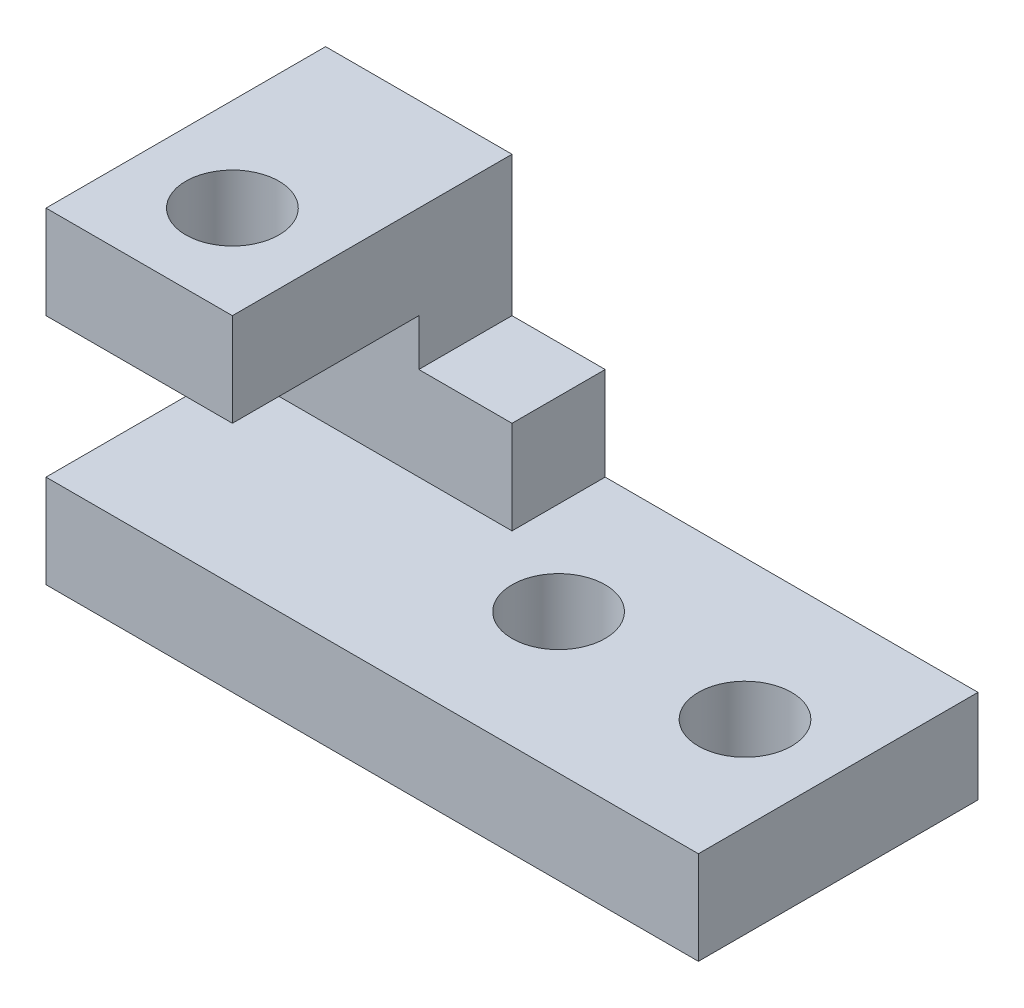
ISO-10303-21;
HEADER;
FILE_DESCRIPTION(('STEP AP214'),'2;1');
FILE_NAME('part.step','',(''),(''),'','','');
FILE_SCHEMA(('AUTOMOTIVE_DESIGN { 1 0 10303 214 1 1 1 1 }'));
ENDSEC;
DATA;
#1=APPLICATION_CONTEXT('core data for automotive mechanical design processes');
#2=APPLICATION_PROTOCOL_DEFINITION('international standard','automotive_design',2000,#1);
#3=PRODUCT_CONTEXT('',#1,'mechanical');
#4=PRODUCT('Part','Part','',(#3));
#5=PRODUCT_RELATED_PRODUCT_CATEGORY('part','',(#4));
#6=PRODUCT_DEFINITION_FORMATION('','',#4);
#7=PRODUCT_DEFINITION_CONTEXT('part definition',#1,'design');
#8=PRODUCT_DEFINITION('design','',#6,#7);
#9=PRODUCT_DEFINITION_SHAPE('','',#8);
#10=(LENGTH_UNIT() NAMED_UNIT(*) SI_UNIT(.MILLI.,.METRE.));
#11=(NAMED_UNIT(*) PLANE_ANGLE_UNIT() SI_UNIT($,.RADIAN.));
#12=(NAMED_UNIT(*) SI_UNIT($,.STERADIAN.) SOLID_ANGLE_UNIT());
#13=UNCERTAINTY_MEASURE_WITH_UNIT(LENGTH_MEASURE(1.E-05),#10,'distance_accuracy_value','');
#14=(GEOMETRIC_REPRESENTATION_CONTEXT(3) GLOBAL_UNCERTAINTY_ASSIGNED_CONTEXT((#13)) GLOBAL_UNIT_ASSIGNED_CONTEXT((#10,
#11,#12)) REPRESENTATION_CONTEXT('',''));
#15=CARTESIAN_POINT('',(0.,0.,0.));
#16=DIRECTION('',(0.,0.,1.));
#17=DIRECTION('',(1.,0.,0.));
#18=AXIS2_PLACEMENT_3D('',#15,#16,#17);
#19=CARTESIAN_POINT('',(0.,35.,-20.));
#20=DIRECTION('',(0.,0.,-1.));
#21=DIRECTION('',(-1.,0.,0.));
#22=AXIS2_PLACEMENT_3D('',#19,#20,#21);
#23=PLANE('',#22);
#24=DIRECTION('',(1.,0.,0.));
#25=VECTOR('',#24,1.);
#26=CARTESIAN_POINT('',(0.,25.,-20.));
#27=LINE('',#26,#25);
#28=CARTESIAN_POINT('',(0.,25.,-20.));
#29=VERTEX_POINT('',#28);
#30=CARTESIAN_POINT('',(20.,25.,-20.));
#31=VERTEX_POINT('',#30);
#32=EDGE_CURVE('E142',#29,#31,#27,.T.);
#33=ORIENTED_EDGE('',*,*,#32,.F.);
#34=DIRECTION('',(0.,-1.,0.));
#35=VECTOR('',#34,1.);
#36=CARTESIAN_POINT('',(0.,35.,-20.));
#37=LINE('',#36,#35);
#38=CARTESIAN_POINT('',(0.,10.,-20.));
#39=VERTEX_POINT('',#38);
#40=EDGE_CURVE('E147',#29,#39,#37,.T.);
#41=ORIENTED_EDGE('',*,*,#40,.T.);
#42=DIRECTION('',(1.,0.,0.));
#43=VECTOR('',#42,1.);
#44=CARTESIAN_POINT('',(0.,10.,-20.));
#45=LINE('',#44,#43);
#46=CARTESIAN_POINT('',(30.,10.,-20.));
#47=VERTEX_POINT('',#46);
#48=EDGE_CURVE('E171',#39,#47,#45,.T.);
#49=ORIENTED_EDGE('',*,*,#48,.T.);
#50=DIRECTION('',(0.,-1.,0.));
#51=VECTOR('',#50,1.);
#52=CARTESIAN_POINT('',(30.,35.,-20.));
#53=LINE('',#52,#51);
#54=CARTESIAN_POINT('',(30.,20.,-20.));
#55=VERTEX_POINT('',#54);
#56=EDGE_CURVE('E194',#55,#47,#53,.T.);
#57=ORIENTED_EDGE('',*,*,#56,.F.);
#58=DIRECTION('',(1.,0.,0.));
#59=VECTOR('',#58,1.);
#60=CARTESIAN_POINT('',(30.,20.,-20.));
#61=LINE('',#60,#59);
#62=CARTESIAN_POINT('',(20.,20.,-20.));
#63=VERTEX_POINT('',#62);
#64=EDGE_CURVE('E153',#63,#55,#61,.T.);
#65=ORIENTED_EDGE('',*,*,#64,.F.);
#66=DIRECTION('',(0.,-1.,0.));
#67=VECTOR('',#66,1.);
#68=CARTESIAN_POINT('',(20.,35.,-20.));
#69=LINE('',#68,#67);
#70=EDGE_CURVE('E149',#31,#63,#69,.T.);
#71=ORIENTED_EDGE('',*,*,#70,.F.);
#72=EDGE_LOOP('',(#33,#41,#49,#57,#65,#71));
#73=FACE_BOUND('',#72,.T.);
#74=ADVANCED_FACE('F39',(#73),#23,.F.);
#75=CARTESIAN_POINT('',(0.,10.,0.));
#76=DIRECTION('',(0.,-1.,0.));
#77=DIRECTION('',(0.,0.,-1.));
#78=AXIS2_PLACEMENT_3D('',#75,#76,#77);
#79=PLANE('',#78);
#80=CARTESIAN_POINT('',(40.,10.,-15.));
#81=DIRECTION('',(0.,1.,0.));
#82=DIRECTION('',(0.,0.,1.));
#83=AXIS2_PLACEMENT_3D('',#80,#81,#82);
#84=CIRCLE('',#83,5.);
#85=CARTESIAN_POINT('',(40.,10.,-9.99999999999999));
#86=VERTEX_POINT('',#85);
#87=EDGE_CURVE('E271',#86,#86,#84,.T.);
#88=ORIENTED_EDGE('',*,*,#87,.F.);
#89=EDGE_LOOP('',(#88));
#90=FACE_BOUND('',#89,.T.);
#91=CARTESIAN_POINT('',(60.,10.,-15.));
#92=DIRECTION('',(0.,1.,0.));
#93=DIRECTION('',(0.,0.,1.));
#94=AXIS2_PLACEMENT_3D('',#91,#92,#93);
#95=CIRCLE('',#94,5.);
#96=CARTESIAN_POINT('',(60.,10.,-9.99999999999999));
#97=VERTEX_POINT('',#96);
#98=EDGE_CURVE('E278',#97,#97,#95,.T.);
#99=ORIENTED_EDGE('',*,*,#98,.F.);
#100=EDGE_LOOP('',(#99));
#101=FACE_BOUND('',#100,.T.);
#102=DIRECTION('',(0.,0.,-1.));
#103=VECTOR('',#102,1.);
#104=CARTESIAN_POINT('',(30.,10.,-30.));
#105=LINE('',#104,#103);
#106=CARTESIAN_POINT('',(30.,10.,-30.));
#107=VERTEX_POINT('',#106);
#108=EDGE_CURVE('E182',#47,#107,#105,.T.);
#109=ORIENTED_EDGE('',*,*,#108,.F.);
#110=ORIENTED_EDGE('',*,*,#48,.F.);
#111=DIRECTION('',(0.,0.,1.));
#112=VECTOR('',#111,1.);
#113=CARTESIAN_POINT('',(0.,10.,0.));
#114=LINE('',#113,#112);
#115=CARTESIAN_POINT('',(0.,10.,0.));
#116=VERTEX_POINT('',#115);
#117=EDGE_CURVE('E200',#39,#116,#114,.T.);
#118=ORIENTED_EDGE('',*,*,#117,.T.);
#119=DIRECTION('',(1.,0.,0.));
#120=VECTOR('',#119,1.);
#121=CARTESIAN_POINT('',(0.,10.,0.));
#122=LINE('',#121,#120);
#123=CARTESIAN_POINT('',(70.,10.,0.));
#124=VERTEX_POINT('',#123);
#125=EDGE_CURVE('E203',#116,#124,#122,.T.);
#126=ORIENTED_EDGE('',*,*,#125,.T.);
#127=DIRECTION('',(0.,0.,-1.));
#128=VECTOR('',#127,1.);
#129=CARTESIAN_POINT('',(70.,10.,0.));
#130=LINE('',#129,#128);
#131=CARTESIAN_POINT('',(70.,10.,-30.));
#132=VERTEX_POINT('',#131);
#133=EDGE_CURVE('E207',#124,#132,#130,.T.);
#134=ORIENTED_EDGE('',*,*,#133,.T.);
#135=DIRECTION('',(-1.,0.,0.));
#136=VECTOR('',#135,1.);
#137=CARTESIAN_POINT('',(0.,10.,-30.));
#138=LINE('',#137,#136);
#139=EDGE_CURVE('E210',#132,#107,#138,.T.);
#140=ORIENTED_EDGE('',*,*,#139,.T.);
#141=EDGE_LOOP('',(#109,#110,#118,#126,#134,#140));
#142=FACE_BOUND('',#141,.T.);
#143=ADVANCED_FACE('F263',(#90,#101,#142),#79,.F.);
#144=CARTESIAN_POINT('',(0.,10.,0.));
#145=DIRECTION('',(1.,0.,0.));
#146=DIRECTION('',(0.,0.,-1.));
#147=AXIS2_PLACEMENT_3D('',#144,#145,#146);
#148=PLANE('',#147);
#149=DIRECTION('',(0.,0.,1.));
#150=VECTOR('',#149,1.);
#151=CARTESIAN_POINT('',(0.,0.,0.));
#152=LINE('',#151,#150);
#153=CARTESIAN_POINT('',(0.,0.,-30.));
#154=VERTEX_POINT('',#153);
#155=CARTESIAN_POINT('',(0.,0.,0.));
#156=VERTEX_POINT('',#155);
#157=EDGE_CURVE('E199',#154,#156,#152,.T.);
#158=ORIENTED_EDGE('',*,*,#157,.T.);
#159=DIRECTION('',(0.,-1.,0.));
#160=VECTOR('',#159,1.);
#161=CARTESIAN_POINT('',(0.,10.,0.));
#162=LINE('',#161,#160);
#163=EDGE_CURVE('E11',#116,#156,#162,.T.);
#164=ORIENTED_EDGE('',*,*,#163,.F.);
#165=ORIENTED_EDGE('',*,*,#117,.F.);
#166=ORIENTED_EDGE('',*,*,#40,.F.);
#167=DIRECTION('',(0.,0.,-1.));
#168=VECTOR('',#167,1.);
#169=CARTESIAN_POINT('',(0.,25.,0.));
#170=LINE('',#169,#168);
#171=CARTESIAN_POINT('',(0.,25.,0.));
#172=VERTEX_POINT('',#171);
#173=EDGE_CURVE('E126',#172,#29,#170,.T.);
#174=ORIENTED_EDGE('',*,*,#173,.F.);
#175=DIRECTION('',(0.,-1.,0.));
#176=VECTOR('',#175,1.);
#177=CARTESIAN_POINT('',(0.,35.,0.));
#178=LINE('',#177,#176);
#179=CARTESIAN_POINT('',(0.,35.,0.));
#180=VERTEX_POINT('',#179);
#181=EDGE_CURVE('E132',#180,#172,#178,.T.);
#182=ORIENTED_EDGE('',*,*,#181,.F.);
#183=DIRECTION('',(0.,0.,1.));
#184=VECTOR('',#183,1.);
#185=CARTESIAN_POINT('',(0.,35.,-30.));
#186=LINE('',#185,#184);
#187=CARTESIAN_POINT('',(0.,35.,-30.));
#188=VERTEX_POINT('',#187);
#189=EDGE_CURVE('E178',#188,#180,#186,.T.);
#190=ORIENTED_EDGE('',*,*,#189,.F.);
#191=DIRECTION('',(0.,-1.,0.));
#192=VECTOR('',#191,1.);
#193=CARTESIAN_POINT('',(0.,10.,-30.));
#194=LINE('',#193,#192);
#195=EDGE_CURVE('E214',#188,#154,#194,.T.);
#196=ORIENTED_EDGE('',*,*,#195,.T.);
#197=EDGE_LOOP('',(#158,#164,#165,#166,#174,#182,#190,#196));
#198=FACE_BOUND('',#197,.T.);
#199=ADVANCED_FACE('F41',(#198),#148,.F.);
#200=CARTESIAN_POINT('',(0.,10.,0.));
#201=DIRECTION('',(0.,0.,-1.));
#202=DIRECTION('',(-1.,0.,0.));
#203=AXIS2_PLACEMENT_3D('',#200,#201,#202);
#204=PLANE('',#203);
#205=DIRECTION('',(1.,0.,0.));
#206=VECTOR('',#205,1.);
#207=CARTESIAN_POINT('',(0.,0.,0.));
#208=LINE('',#207,#206);
#209=CARTESIAN_POINT('',(70.,0.,0.));
#210=VERTEX_POINT('',#209);
#211=EDGE_CURVE('E217',#156,#210,#208,.T.);
#212=ORIENTED_EDGE('',*,*,#211,.T.);
#213=DIRECTION('',(0.,-1.,0.));
#214=VECTOR('',#213,1.);
#215=CARTESIAN_POINT('',(70.,10.,0.));
#216=LINE('',#215,#214);
#217=EDGE_CURVE('E49',#124,#210,#216,.T.);
#218=ORIENTED_EDGE('',*,*,#217,.F.);
#219=ORIENTED_EDGE('',*,*,#125,.F.);
#220=ORIENTED_EDGE('',*,*,#163,.T.);
#221=EDGE_LOOP('',(#212,#218,#219,#220));
#222=FACE_BOUND('',#221,.T.);
#223=ADVANCED_FACE('F325',(#222),#204,.F.);
#224=CARTESIAN_POINT('',(70.,10.,0.));
#225=DIRECTION('',(-1.,0.,0.));
#226=DIRECTION('',(0.,0.,1.));
#227=AXIS2_PLACEMENT_3D('',#224,#225,#226);
#228=PLANE('',#227);
#229=DIRECTION('',(0.,0.,-1.));
#230=VECTOR('',#229,1.);
#231=CARTESIAN_POINT('',(70.,0.,0.));
#232=LINE('',#231,#230);
#233=CARTESIAN_POINT('',(70.,0.,-30.));
#234=VERTEX_POINT('',#233);
#235=EDGE_CURVE('E220',#210,#234,#232,.T.);
#236=ORIENTED_EDGE('',*,*,#235,.T.);
#237=DIRECTION('',(0.,-1.,0.));
#238=VECTOR('',#237,1.);
#239=CARTESIAN_POINT('',(70.,10.,-30.));
#240=LINE('',#239,#238);
#241=EDGE_CURVE('E228',#132,#234,#240,.T.);
#242=ORIENTED_EDGE('',*,*,#241,.F.);
#243=ORIENTED_EDGE('',*,*,#133,.F.);
#244=ORIENTED_EDGE('',*,*,#217,.T.);
#245=EDGE_LOOP('',(#236,#242,#243,#244));
#246=FACE_BOUND('',#245,.T.);
#247=ADVANCED_FACE('F238',(#246),#228,.F.);
#248=CARTESIAN_POINT('',(0.,10.,-30.));
#249=DIRECTION('',(0.,0.,1.));
#250=DIRECTION('',(1.,0.,0.));
#251=AXIS2_PLACEMENT_3D('',#248,#249,#250);
#252=PLANE('',#251);
#253=DIRECTION('',(0.,-1.,0.));
#254=VECTOR('',#253,1.);
#255=CARTESIAN_POINT('',(20.,35.,-30.));
#256=LINE('',#255,#254);
#257=CARTESIAN_POINT('',(20.,35.,-30.));
#258=VERTEX_POINT('',#257);
#259=CARTESIAN_POINT('',(20.,20.,-30.));
#260=VERTEX_POINT('',#259);
#261=EDGE_CURVE('E63',#258,#260,#256,.T.);
#262=ORIENTED_EDGE('',*,*,#261,.T.);
#263=DIRECTION('',(1.,0.,0.));
#264=VECTOR('',#263,1.);
#265=CARTESIAN_POINT('',(30.,20.,-30.));
#266=LINE('',#265,#264);
#267=CARTESIAN_POINT('',(30.,20.,-30.));
#268=VERTEX_POINT('',#267);
#269=EDGE_CURVE('E160',#260,#268,#266,.T.);
#270=ORIENTED_EDGE('',*,*,#269,.T.);
#271=DIRECTION('',(0.,-1.,0.));
#272=VECTOR('',#271,1.);
#273=CARTESIAN_POINT('',(30.,35.,-30.));
#274=LINE('',#273,#272);
#275=EDGE_CURVE('E185',#268,#107,#274,.T.);
#276=ORIENTED_EDGE('',*,*,#275,.T.);
#277=ORIENTED_EDGE('',*,*,#139,.F.);
#278=ORIENTED_EDGE('',*,*,#241,.T.);
#279=DIRECTION('',(-1.,0.,0.));
#280=VECTOR('',#279,1.);
#281=CARTESIAN_POINT('',(0.,0.,-30.));
#282=LINE('',#281,#280);
#283=EDGE_CURVE('E204',#234,#154,#282,.T.);
#284=ORIENTED_EDGE('',*,*,#283,.T.);
#285=ORIENTED_EDGE('',*,*,#195,.F.);
#286=DIRECTION('',(-1.,0.,0.));
#287=VECTOR('',#286,1.);
#288=CARTESIAN_POINT('',(0.,35.,-30.));
#289=LINE('',#288,#287);
#290=EDGE_CURVE('E181',#258,#188,#289,.T.);
#291=ORIENTED_EDGE('',*,*,#290,.F.);
#292=EDGE_LOOP('',(#262,#270,#276,#277,#278,#284,#285,#291));
#293=FACE_BOUND('',#292,.T.);
#294=ADVANCED_FACE('F248',(#293),#252,.F.);
#295=CARTESIAN_POINT('',(0.,0.,0.));
#296=DIRECTION('',(0.,-1.,0.));
#297=DIRECTION('',(0.,0.,-1.));
#298=AXIS2_PLACEMENT_3D('',#295,#296,#297);
#299=PLANE('',#298);
#300=CARTESIAN_POINT('',(40.,0.,-15.));
#301=DIRECTION('',(0.,1.,0.));
#302=DIRECTION('',(0.,0.,1.));
#303=AXIS2_PLACEMENT_3D('',#300,#301,#302);
#304=CIRCLE('',#303,5.);
#305=CARTESIAN_POINT('',(40.,0.,-9.99999999999999));
#306=VERTEX_POINT('',#305);
#307=EDGE_CURVE('E268',#306,#306,#304,.T.);
#308=ORIENTED_EDGE('',*,*,#307,.T.);
#309=EDGE_LOOP('',(#308));
#310=FACE_BOUND('',#309,.T.);
#311=CARTESIAN_POINT('',(60.,0.,-15.));
#312=DIRECTION('',(0.,1.,0.));
#313=DIRECTION('',(0.,0.,1.));
#314=AXIS2_PLACEMENT_3D('',#311,#312,#313);
#315=CIRCLE('',#314,5.);
#316=CARTESIAN_POINT('',(60.,0.,-9.99999999999999));
#317=VERTEX_POINT('',#316);
#318=EDGE_CURVE('E282',#317,#317,#315,.T.);
#319=ORIENTED_EDGE('',*,*,#318,.T.);
#320=EDGE_LOOP('',(#319));
#321=FACE_BOUND('',#320,.T.);
#322=ORIENTED_EDGE('',*,*,#157,.F.);
#323=ORIENTED_EDGE('',*,*,#283,.F.);
#324=ORIENTED_EDGE('',*,*,#235,.F.);
#325=ORIENTED_EDGE('',*,*,#211,.F.);
#326=EDGE_LOOP('',(#322,#323,#324,#325));
#327=FACE_BOUND('',#326,.T.);
#328=ADVANCED_FACE('F245',(#310,#321,#327),#299,.T.);
#329=CARTESIAN_POINT('',(30.,35.,-30.));
#330=DIRECTION('',(-1.,0.,0.));
#331=DIRECTION('',(0.,0.,1.));
#332=AXIS2_PLACEMENT_3D('',#329,#330,#331);
#333=PLANE('',#332);
#334=ORIENTED_EDGE('',*,*,#275,.F.);
#335=DIRECTION('',(0.,0.,1.));
#336=VECTOR('',#335,1.);
#337=CARTESIAN_POINT('',(30.,20.,-30.));
#338=LINE('',#337,#336);
#339=EDGE_CURVE('E167',#268,#55,#338,.T.);
#340=ORIENTED_EDGE('',*,*,#339,.T.);
#341=ORIENTED_EDGE('',*,*,#56,.T.);
#342=ORIENTED_EDGE('',*,*,#108,.T.);
#343=EDGE_LOOP('',(#334,#340,#341,#342));
#344=FACE_BOUND('',#343,.T.);
#345=ADVANCED_FACE('F258',(#344),#333,.F.);
#346=CARTESIAN_POINT('',(0.,35.,0.));
#347=DIRECTION('',(0.,1.,0.));
#348=DIRECTION('',(0.,0.,1.));
#349=AXIS2_PLACEMENT_3D('',#346,#347,#348);
#350=PLANE('',#349);
#351=CARTESIAN_POINT('',(10.,35.,-10.));
#352=DIRECTION('',(0.,1.,0.));
#353=DIRECTION('',(0.,0.,1.));
#354=AXIS2_PLACEMENT_3D('',#351,#352,#353);
#355=CIRCLE('',#354,5.);
#356=CARTESIAN_POINT('',(10.,35.,-5.));
#357=VERTEX_POINT('',#356);
#358=EDGE_CURVE('E289',#357,#357,#355,.T.);
#359=ORIENTED_EDGE('',*,*,#358,.F.);
#360=EDGE_LOOP('',(#359));
#361=FACE_BOUND('',#360,.T.);
#362=DIRECTION('',(0.,0.,1.));
#363=VECTOR('',#362,1.);
#364=CARTESIAN_POINT('',(20.,35.,-30.));
#365=LINE('',#364,#363);
#366=CARTESIAN_POINT('',(20.,35.,0.));
#367=VERTEX_POINT('',#366);
#368=EDGE_CURVE('E163',#258,#367,#365,.T.);
#369=ORIENTED_EDGE('',*,*,#368,.F.);
#370=ORIENTED_EDGE('',*,*,#290,.T.);
#371=ORIENTED_EDGE('',*,*,#189,.T.);
#372=DIRECTION('',(-1.,0.,0.));
#373=VECTOR('',#372,1.);
#374=CARTESIAN_POINT('',(0.,35.,0.));
#375=LINE('',#374,#373);
#376=EDGE_CURVE('E138',#367,#180,#375,.T.);
#377=ORIENTED_EDGE('',*,*,#376,.F.);
#378=EDGE_LOOP('',(#369,#370,#371,#377));
#379=FACE_BOUND('',#378,.T.);
#380=ADVANCED_FACE('F253',(#361,#379),#350,.T.);
#381=CARTESIAN_POINT('',(30.,20.,-30.));
#382=DIRECTION('',(0.,-1.,0.));
#383=DIRECTION('',(0.,0.,-1.));
#384=AXIS2_PLACEMENT_3D('',#381,#382,#383);
#385=PLANE('',#384);
#386=ORIENTED_EDGE('',*,*,#64,.T.);
#387=ORIENTED_EDGE('',*,*,#339,.F.);
#388=ORIENTED_EDGE('',*,*,#269,.F.);
#389=DIRECTION('',(0.,0.,1.));
#390=VECTOR('',#389,1.);
#391=CARTESIAN_POINT('',(20.,20.,-30.));
#392=LINE('',#391,#390);
#393=EDGE_CURVE('E172',#260,#63,#392,.T.);
#394=ORIENTED_EDGE('',*,*,#393,.T.);
#395=EDGE_LOOP('',(#386,#387,#388,#394));
#396=FACE_BOUND('',#395,.T.);
#397=ADVANCED_FACE('F375',(#396),#385,.F.);
#398=CARTESIAN_POINT('',(20.,35.,-30.));
#399=DIRECTION('',(-1.,0.,0.));
#400=DIRECTION('',(0.,0.,1.));
#401=AXIS2_PLACEMENT_3D('',#398,#399,#400);
#402=PLANE('',#401);
#403=ORIENTED_EDGE('',*,*,#368,.T.);
#404=DIRECTION('',(0.,1.,0.));
#405=VECTOR('',#404,1.);
#406=CARTESIAN_POINT('',(20.,35.,0.));
#407=LINE('',#406,#405);
#408=CARTESIAN_POINT('',(20.,25.,0.));
#409=VERTEX_POINT('',#408);
#410=EDGE_CURVE('E131',#409,#367,#407,.T.);
#411=ORIENTED_EDGE('',*,*,#410,.F.);
#412=DIRECTION('',(0.,0.,-1.));
#413=VECTOR('',#412,1.);
#414=CARTESIAN_POINT('',(20.,25.,0.));
#415=LINE('',#414,#413);
#416=EDGE_CURVE('E56',#409,#31,#415,.T.);
#417=ORIENTED_EDGE('',*,*,#416,.T.);
#418=ORIENTED_EDGE('',*,*,#70,.T.);
#419=ORIENTED_EDGE('',*,*,#393,.F.);
#420=ORIENTED_EDGE('',*,*,#261,.F.);
#421=EDGE_LOOP('',(#403,#411,#417,#418,#419,#420));
#422=FACE_BOUND('',#421,.T.);
#423=ADVANCED_FACE('F386',(#422),#402,.F.);
#424=CARTESIAN_POINT('',(0.,25.,0.));
#425=DIRECTION('',(0.,1.,0.));
#426=DIRECTION('',(0.,0.,1.));
#427=AXIS2_PLACEMENT_3D('',#424,#425,#426);
#428=PLANE('',#427);
#429=CARTESIAN_POINT('',(10.,25.,-10.));
#430=DIRECTION('',(0.,1.,0.));
#431=DIRECTION('',(0.,0.,1.));
#432=AXIS2_PLACEMENT_3D('',#429,#430,#431);
#433=CIRCLE('',#432,5.);
#434=CARTESIAN_POINT('',(10.,25.,-5.));
#435=VERTEX_POINT('',#434);
#436=EDGE_CURVE('E43',#435,#435,#433,.T.);
#437=ORIENTED_EDGE('',*,*,#436,.T.);
#438=EDGE_LOOP('',(#437));
#439=FACE_BOUND('',#438,.T.);
#440=ORIENTED_EDGE('',*,*,#32,.T.);
#441=ORIENTED_EDGE('',*,*,#416,.F.);
#442=DIRECTION('',(1.,0.,0.));
#443=VECTOR('',#442,1.);
#444=CARTESIAN_POINT('',(0.,25.,0.));
#445=LINE('',#444,#443);
#446=EDGE_CURVE('E122',#172,#409,#445,.T.);
#447=ORIENTED_EDGE('',*,*,#446,.F.);
#448=ORIENTED_EDGE('',*,*,#173,.T.);
#449=EDGE_LOOP('',(#440,#441,#447,#448));
#450=FACE_BOUND('',#449,.T.);
#451=ADVANCED_FACE('F124',(#439,#450),#428,.F.);
#452=CARTESIAN_POINT('',(0.,0.,0.));
#453=DIRECTION('',(0.,0.,1.));
#454=DIRECTION('',(1.,0.,0.));
#455=AXIS2_PLACEMENT_3D('',#452,#453,#454);
#456=PLANE('',#455);
#457=ORIENTED_EDGE('',*,*,#181,.T.);
#458=ORIENTED_EDGE('',*,*,#446,.T.);
#459=ORIENTED_EDGE('',*,*,#410,.T.);
#460=ORIENTED_EDGE('',*,*,#376,.T.);
#461=EDGE_LOOP('',(#457,#458,#459,#460));
#462=FACE_BOUND('',#461,.T.);
#463=ADVANCED_FACE('F136',(#462),#456,.T.);
#464=CARTESIAN_POINT('',(60.,0.,-15.));
#465=DIRECTION('',(0.,1.,0.));
#466=DIRECTION('',(0.,0.,1.));
#467=AXIS2_PLACEMENT_3D('',#464,#465,#466);
#468=CYLINDRICAL_SURFACE('',#467,5.);
#469=ORIENTED_EDGE('',*,*,#318,.F.);
#470=EDGE_LOOP('',(#469));
#471=FACE_BOUND('',#470,.T.);
#472=ORIENTED_EDGE('',*,*,#98,.T.);
#473=EDGE_LOOP('',(#472));
#474=FACE_BOUND('',#473,.T.);
#475=ADVANCED_FACE('F306',(#471,#474),#468,.F.);
#476=CARTESIAN_POINT('',(40.,0.,-15.));
#477=DIRECTION('',(0.,1.,0.));
#478=DIRECTION('',(0.,0.,1.));
#479=AXIS2_PLACEMENT_3D('',#476,#477,#478);
#480=CYLINDRICAL_SURFACE('',#479,5.);
#481=ORIENTED_EDGE('',*,*,#307,.F.);
#482=EDGE_LOOP('',(#481));
#483=FACE_BOUND('',#482,.T.);
#484=ORIENTED_EDGE('',*,*,#87,.T.);
#485=EDGE_LOOP('',(#484));
#486=FACE_BOUND('',#485,.T.);
#487=ADVANCED_FACE('F301',(#483,#486),#480,.F.);
#488=CARTESIAN_POINT('',(10.,20.,-10.));
#489=DIRECTION('',(0.,1.,0.));
#490=DIRECTION('',(0.,0.,1.));
#491=AXIS2_PLACEMENT_3D('',#488,#489,#490);
#492=CYLINDRICAL_SURFACE('',#491,5.);
#493=ORIENTED_EDGE('',*,*,#358,.T.);
#494=EDGE_LOOP('',(#493));
#495=FACE_BOUND('',#494,.T.);
#496=ORIENTED_EDGE('',*,*,#436,.F.);
#497=EDGE_LOOP('',(#496));
#498=FACE_BOUND('',#497,.T.);
#499=ADVANCED_FACE('F299',(#495,#498),#492,.F.);
#500=CLOSED_SHELL('',(#74,#143,#199,#223,#247,#294,#328,#345,#380,#397,#423,#451,#463,#475,#487,#499));
#501=MANIFOLD_SOLID_BREP('B2',#500);
#502=ADVANCED_BREP_SHAPE_REPRESENTATION('',(#18,#501),#14);
#503=SHAPE_DEFINITION_REPRESENTATION(#9,#502);
ENDSEC;
END-ISO-10303-21;
